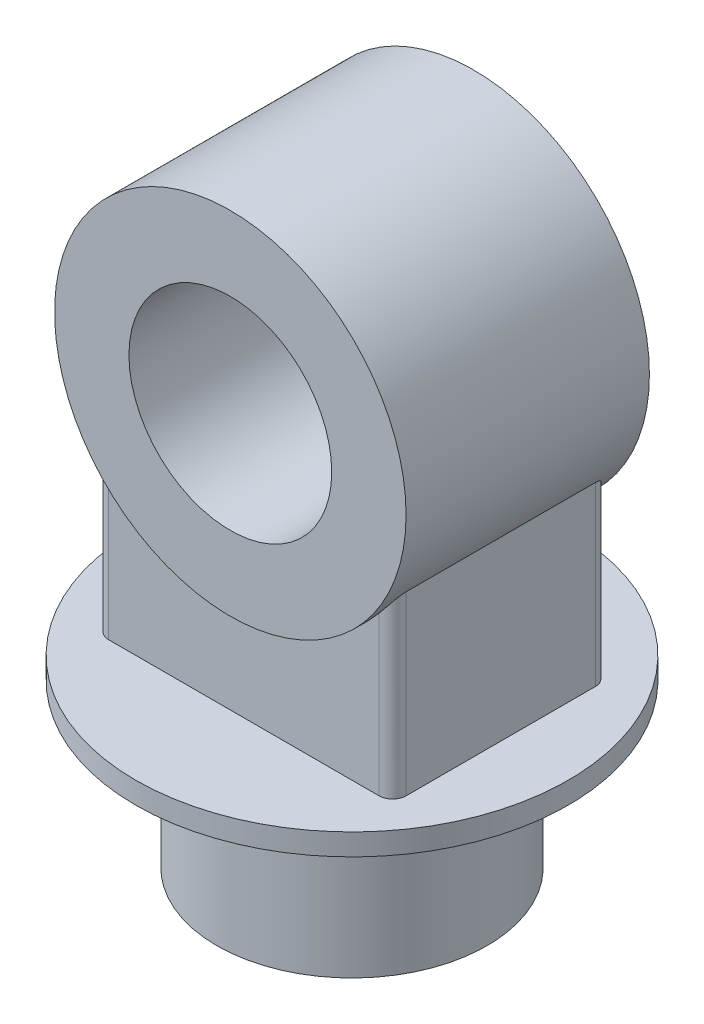
ISO-10303-21;
HEADER;
FILE_DESCRIPTION(('STEP AP214'),'2;1');
FILE_NAME('part.step','',(''),(''),'','','');
FILE_SCHEMA(('AUTOMOTIVE_DESIGN { 1 0 10303 214 1 1 1 1 }'));
ENDSEC;
DATA;
#1=APPLICATION_CONTEXT('core data for automotive mechanical design processes');
#2=APPLICATION_PROTOCOL_DEFINITION('international standard','automotive_design',2000,#1);
#3=PRODUCT_CONTEXT('',#1,'mechanical');
#4=PRODUCT('Part','Part','',(#3));
#5=PRODUCT_RELATED_PRODUCT_CATEGORY('part','',(#4));
#6=PRODUCT_DEFINITION_FORMATION('','',#4);
#7=PRODUCT_DEFINITION_CONTEXT('part definition',#1,'design');
#8=PRODUCT_DEFINITION('design','',#6,#7);
#9=PRODUCT_DEFINITION_SHAPE('','',#8);
#10=(LENGTH_UNIT() NAMED_UNIT(*) SI_UNIT(.MILLI.,.METRE.));
#11=(NAMED_UNIT(*) PLANE_ANGLE_UNIT() SI_UNIT($,.RADIAN.));
#12=(NAMED_UNIT(*) SI_UNIT($,.STERADIAN.) SOLID_ANGLE_UNIT());
#13=UNCERTAINTY_MEASURE_WITH_UNIT(LENGTH_MEASURE(1.E-05),#10,'distance_accuracy_value','');
#14=(GEOMETRIC_REPRESENTATION_CONTEXT(3) GLOBAL_UNCERTAINTY_ASSIGNED_CONTEXT((#13)) GLOBAL_UNIT_ASSIGNED_CONTEXT((#10,
#11,#12)) REPRESENTATION_CONTEXT('',''));
#15=CARTESIAN_POINT('',(0.,0.,0.));
#16=DIRECTION('',(0.,0.,1.));
#17=DIRECTION('',(1.,0.,0.));
#18=AXIS2_PLACEMENT_3D('',#15,#16,#17);
#19=CARTESIAN_POINT('',(0.,120.,0.));
#20=DIRECTION('',(0.,-1.,0.));
#21=DIRECTION('',(0.,0.,-1.));
#22=AXIS2_PLACEMENT_3D('',#19,#20,#21);
#23=CYLINDRICAL_SURFACE('',#22,100.);
#24=CARTESIAN_POINT('',(0.,120.,0.));
#25=DIRECTION('',(0.,1.,0.));
#26=DIRECTION('',(0.,0.,1.));
#27=AXIS2_PLACEMENT_3D('',#24,#25,#26);
#28=CIRCLE('',#27,100.);
#29=CARTESIAN_POINT('',(0.,120.,100.));
#30=VERTEX_POINT('',#29);
#31=EDGE_CURVE('E140',#30,#30,#28,.T.);
#32=ORIENTED_EDGE('',*,*,#31,.F.);
#33=EDGE_LOOP('',(#32));
#34=FACE_BOUND('',#33,.T.);
#35=CARTESIAN_POINT('',(0.,0.,0.));
#36=DIRECTION('',(0.,1.,0.));
#37=DIRECTION('',(0.,0.,1.));
#38=AXIS2_PLACEMENT_3D('',#35,#36,#37);
#39=CIRCLE('',#38,100.);
#40=CARTESIAN_POINT('',(0.,0.,100.));
#41=VERTEX_POINT('',#40);
#42=EDGE_CURVE('E209',#41,#41,#39,.T.);
#43=ORIENTED_EDGE('',*,*,#42,.T.);
#44=EDGE_LOOP('',(#43));
#45=FACE_BOUND('',#44,.T.);
#46=ADVANCED_FACE('F39',(#34,#45),#23,.T.);
#47=CARTESIAN_POINT('',(0.,0.,0.));
#48=DIRECTION('',(0.,1.,0.));
#49=DIRECTION('',(0.,0.,1.));
#50=AXIS2_PLACEMENT_3D('',#47,#48,#49);
#51=PLANE('',#50);
#52=ORIENTED_EDGE('',*,*,#42,.F.);
#53=EDGE_LOOP('',(#52));
#54=FACE_BOUND('',#53,.T.);
#55=ADVANCED_FACE('F217',(#54),#51,.F.);
#56=CARTESIAN_POINT('',(0.,136.,0.));
#57=DIRECTION('',(0.,-1.,0.));
#58=DIRECTION('',(0.,0.,-1.));
#59=AXIS2_PLACEMENT_3D('',#56,#57,#58);
#60=CYLINDRICAL_SURFACE('',#59,160.);
#61=CARTESIAN_POINT('',(0.,136.,0.));
#62=DIRECTION('',(0.,1.,0.));
#63=DIRECTION('',(0.,0.,1.));
#64=AXIS2_PLACEMENT_3D('',#61,#62,#63);
#65=CIRCLE('',#64,160.);
#66=CARTESIAN_POINT('',(0.,136.,160.));
#67=VERTEX_POINT('',#66);
#68=EDGE_CURVE('E206',#67,#67,#65,.T.);
#69=ORIENTED_EDGE('',*,*,#68,.F.);
#70=EDGE_LOOP('',(#69));
#71=FACE_BOUND('',#70,.T.);
#72=CARTESIAN_POINT('',(0.,120.,0.));
#73=DIRECTION('',(0.,1.,0.));
#74=DIRECTION('',(0.,0.,1.));
#75=AXIS2_PLACEMENT_3D('',#72,#73,#74);
#76=CIRCLE('',#75,160.);
#77=CARTESIAN_POINT('',(0.,120.,160.));
#78=VERTEX_POINT('',#77);
#79=EDGE_CURVE('E202',#78,#78,#76,.T.);
#80=ORIENTED_EDGE('',*,*,#79,.T.);
#81=EDGE_LOOP('',(#80));
#82=FACE_BOUND('',#81,.T.);
#83=ADVANCED_FACE('F219',(#71,#82),#60,.T.);
#84=CARTESIAN_POINT('',(0.,136.,0.));
#85=DIRECTION('',(0.,1.,0.));
#86=DIRECTION('',(0.,0.,1.));
#87=AXIS2_PLACEMENT_3D('',#84,#85,#86);
#88=PLANE('',#87);
#89=DIRECTION('',(0.,0.,1.));
#90=VECTOR('',#89,1.);
#91=CARTESIAN_POINT('',(-110.,136.,80.));
#92=LINE('',#91,#90);
#93=CARTESIAN_POINT('',(-110.,136.,-70.));
#94=VERTEX_POINT('',#93);
#95=CARTESIAN_POINT('',(-110.,136.,70.));
#96=VERTEX_POINT('',#95);
#97=EDGE_CURVE('E367',#94,#96,#92,.T.);
#98=ORIENTED_EDGE('',*,*,#97,.F.);
#99=CARTESIAN_POINT('',(-100.,136.,-70.));
#100=DIRECTION('',(0.,1.,0.));
#101=DIRECTION('',(0.,0.,1.));
#102=AXIS2_PLACEMENT_3D('',#99,#100,#101);
#103=CIRCLE('',#102,10.);
#104=CARTESIAN_POINT('',(-100.,136.,-80.));
#105=VERTEX_POINT('',#104);
#106=EDGE_CURVE('E122',#94,#105,#103,.F.);
#107=ORIENTED_EDGE('',*,*,#106,.T.);
#108=DIRECTION('',(-1.,0.,0.));
#109=VECTOR('',#108,1.);
#110=CARTESIAN_POINT('',(110.,136.,-80.));
#111=LINE('',#110,#109);
#112=CARTESIAN_POINT('',(100.,136.,-80.));
#113=VERTEX_POINT('',#112);
#114=EDGE_CURVE('E364',#113,#105,#111,.T.);
#115=ORIENTED_EDGE('',*,*,#114,.F.);
#116=CARTESIAN_POINT('',(100.,136.,-70.));
#117=DIRECTION('',(0.,1.,0.));
#118=DIRECTION('',(0.,0.,1.));
#119=AXIS2_PLACEMENT_3D('',#116,#117,#118);
#120=CIRCLE('',#119,10.);
#121=CARTESIAN_POINT('',(110.,136.,-70.));
#122=VERTEX_POINT('',#121);
#123=EDGE_CURVE('E60',#113,#122,#120,.F.);
#124=ORIENTED_EDGE('',*,*,#123,.T.);
#125=DIRECTION('',(0.,0.,-1.));
#126=VECTOR('',#125,1.);
#127=CARTESIAN_POINT('',(110.,136.,80.));
#128=LINE('',#127,#126);
#129=CARTESIAN_POINT('',(110.,136.,70.));
#130=VERTEX_POINT('',#129);
#131=EDGE_CURVE('E192',#130,#122,#128,.T.);
#132=ORIENTED_EDGE('',*,*,#131,.F.);
#133=CARTESIAN_POINT('',(100.,136.,70.));
#134=DIRECTION('',(0.,1.,0.));
#135=DIRECTION('',(0.,0.,1.));
#136=AXIS2_PLACEMENT_3D('',#133,#134,#135);
#137=CIRCLE('',#136,10.);
#138=CARTESIAN_POINT('',(100.,136.,80.));
#139=VERTEX_POINT('',#138);
#140=EDGE_CURVE('E53',#130,#139,#137,.F.);
#141=ORIENTED_EDGE('',*,*,#140,.T.);
#142=DIRECTION('',(1.,0.,0.));
#143=VECTOR('',#142,1.);
#144=CARTESIAN_POINT('',(110.,136.,80.));
#145=LINE('',#144,#143);
#146=CARTESIAN_POINT('',(-100.,136.,80.));
#147=VERTEX_POINT('',#146);
#148=EDGE_CURVE('E191',#147,#139,#145,.T.);
#149=ORIENTED_EDGE('',*,*,#148,.F.);
#150=CARTESIAN_POINT('',(-100.,136.,70.));
#151=DIRECTION('',(0.,1.,0.));
#152=DIRECTION('',(0.,0.,1.));
#153=AXIS2_PLACEMENT_3D('',#150,#151,#152);
#154=CIRCLE('',#153,10.);
#155=EDGE_CURVE('E123',#147,#96,#154,.F.);
#156=ORIENTED_EDGE('',*,*,#155,.T.);
#157=EDGE_LOOP('',(#98,#107,#115,#124,#132,#141,#149,#156));
#158=FACE_BOUND('',#157,.T.);
#159=ORIENTED_EDGE('',*,*,#68,.T.);
#160=EDGE_LOOP('',(#159));
#161=FACE_BOUND('',#160,.T.);
#162=ADVANCED_FACE('F189',(#158,#161),#88,.T.);
#163=CARTESIAN_POINT('',(0.,120.,0.));
#164=DIRECTION('',(0.,1.,0.));
#165=DIRECTION('',(0.,0.,1.));
#166=AXIS2_PLACEMENT_3D('',#163,#164,#165);
#167=PLANE('',#166);
#168=ORIENTED_EDGE('',*,*,#31,.T.);
#169=EDGE_LOOP('',(#168));
#170=FACE_BOUND('',#169,.T.);
#171=ORIENTED_EDGE('',*,*,#79,.F.);
#172=EDGE_LOOP('',(#171));
#173=FACE_BOUND('',#172,.T.);
#174=ADVANCED_FACE('F228',(#170,#173),#167,.F.);
#175=CARTESIAN_POINT('',(110.,466.002,80.));
#176=DIRECTION('',(0.,0.,-1.));
#177=DIRECTION('',(-1.,0.,0.));
#178=AXIS2_PLACEMENT_3D('',#175,#176,#177);
#179=PLANE('',#178);
#180=CARTESIAN_POINT('',(0.,336.,80.));
#181=DIRECTION('',(0.,0.,-1.));
#182=DIRECTION('',(-1.,0.,0.));
#183=AXIS2_PLACEMENT_3D('',#180,#181,#182);
#184=CIRCLE('',#183,130.);
#185=CARTESIAN_POINT('',(-100.,252.933761370819,80.));
#186=VERTEX_POINT('',#185);
#187=CARTESIAN_POINT('',(100.,252.933761370819,80.));
#188=VERTEX_POINT('',#187);
#189=EDGE_CURVE('E115',#186,#188,#184,.F.);
#190=ORIENTED_EDGE('',*,*,#189,.F.);
#191=DIRECTION('',(0.,-1.,0.));
#192=VECTOR('',#191,1.);
#193=CARTESIAN_POINT('',(-100.,466.002,80.));
#194=LINE('',#193,#192);
#195=EDGE_CURVE('E129',#186,#147,#194,.T.);
#196=ORIENTED_EDGE('',*,*,#195,.T.);
#197=ORIENTED_EDGE('',*,*,#148,.T.);
#198=DIRECTION('',(0.,-1.,0.));
#199=VECTOR('',#198,1.);
#200=CARTESIAN_POINT('',(100.,466.002,80.));
#201=LINE('',#200,#199);
#202=EDGE_CURVE('E131',#139,#188,#201,.F.);
#203=ORIENTED_EDGE('',*,*,#202,.T.);
#204=EDGE_LOOP('',(#190,#196,#197,#203));
#205=FACE_BOUND('',#204,.T.);
#206=ADVANCED_FACE('F127',(#205),#179,.F.);
#207=CARTESIAN_POINT('',(-110.,466.002,80.));
#208=DIRECTION('',(1.,0.,0.));
#209=DIRECTION('',(0.,0.,-1.));
#210=AXIS2_PLACEMENT_3D('',#207,#208,#209);
#211=PLANE('',#210);
#212=ORIENTED_EDGE('',*,*,#97,.T.);
#213=DIRECTION('',(0.,-1.,0.));
#214=VECTOR('',#213,1.);
#215=CARTESIAN_POINT('',(-110.,466.002,70.));
#216=LINE('',#215,#214);
#217=CARTESIAN_POINT('',(-110.,266.717967697245,70.));
#218=VERTEX_POINT('',#217);
#219=EDGE_CURVE('E138',#96,#218,#216,.F.);
#220=ORIENTED_EDGE('',*,*,#219,.T.);
#221=DIRECTION('',(0.,0.,-1.));
#222=VECTOR('',#221,1.);
#223=CARTESIAN_POINT('',(-110.,266.717967697245,90.));
#224=LINE('',#223,#222);
#225=CARTESIAN_POINT('',(-110.,266.717967697245,-69.9999999999999));
#226=VERTEX_POINT('',#225);
#227=EDGE_CURVE('E118',#226,#218,#224,.F.);
#228=ORIENTED_EDGE('',*,*,#227,.F.);
#229=DIRECTION('',(0.,-1.,0.));
#230=VECTOR('',#229,1.);
#231=CARTESIAN_POINT('',(-110.,466.002,-70.));
#232=LINE('',#231,#230);
#233=EDGE_CURVE('E135',#226,#94,#232,.T.);
#234=ORIENTED_EDGE('',*,*,#233,.T.);
#235=EDGE_LOOP('',(#212,#220,#228,#234));
#236=FACE_BOUND('',#235,.T.);
#237=ADVANCED_FACE('F234',(#236),#211,.F.);
#238=CARTESIAN_POINT('',(110.,466.002,80.));
#239=DIRECTION('',(-1.,0.,0.));
#240=DIRECTION('',(0.,0.,1.));
#241=AXIS2_PLACEMENT_3D('',#238,#239,#240);
#242=PLANE('',#241);
#243=ORIENTED_EDGE('',*,*,#131,.T.);
#244=DIRECTION('',(0.,-1.,0.));
#245=VECTOR('',#244,1.);
#246=CARTESIAN_POINT('',(110.,466.002,-70.));
#247=LINE('',#246,#245);
#248=CARTESIAN_POINT('',(110.,266.717967697245,-69.9999999999999));
#249=VERTEX_POINT('',#248);
#250=EDGE_CURVE('E152',#122,#249,#247,.F.);
#251=ORIENTED_EDGE('',*,*,#250,.T.);
#252=DIRECTION('',(0.,0.,-1.));
#253=VECTOR('',#252,1.);
#254=CARTESIAN_POINT('',(110.,266.717967697245,90.));
#255=LINE('',#254,#253);
#256=CARTESIAN_POINT('',(110.,266.717967697245,70.));
#257=VERTEX_POINT('',#256);
#258=EDGE_CURVE('E132',#257,#249,#255,.T.);
#259=ORIENTED_EDGE('',*,*,#258,.F.);
#260=DIRECTION('',(0.,-1.,0.));
#261=VECTOR('',#260,1.);
#262=CARTESIAN_POINT('',(110.,466.002,70.));
#263=LINE('',#262,#261);
#264=EDGE_CURVE('E150',#257,#130,#263,.T.);
#265=ORIENTED_EDGE('',*,*,#264,.T.);
#266=EDGE_LOOP('',(#243,#251,#259,#265));
#267=FACE_BOUND('',#266,.T.);
#268=ADVANCED_FACE('F198',(#267),#242,.F.);
#269=CARTESIAN_POINT('',(110.,466.002,-80.));
#270=DIRECTION('',(0.,0.,1.));
#271=DIRECTION('',(1.,0.,0.));
#272=AXIS2_PLACEMENT_3D('',#269,#270,#271);
#273=PLANE('',#272);
#274=ORIENTED_EDGE('',*,*,#114,.T.);
#275=DIRECTION('',(0.,-1.,0.));
#276=VECTOR('',#275,1.);
#277=CARTESIAN_POINT('',(-100.,466.002,-80.));
#278=LINE('',#277,#276);
#279=CARTESIAN_POINT('',(-100.,252.933761370819,-79.9999999999999));
#280=VERTEX_POINT('',#279);
#281=EDGE_CURVE('E148',#105,#280,#278,.F.);
#282=ORIENTED_EDGE('',*,*,#281,.T.);
#283=CARTESIAN_POINT('',(0.,336.,-80.));
#284=DIRECTION('',(0.,0.,1.));
#285=DIRECTION('',(1.,0.,0.));
#286=AXIS2_PLACEMENT_3D('',#283,#284,#285);
#287=CIRCLE('',#286,130.);
#288=CARTESIAN_POINT('',(100.,252.933761370819,-80.));
#289=VERTEX_POINT('',#288);
#290=EDGE_CURVE('E200',#289,#280,#287,.F.);
#291=ORIENTED_EDGE('',*,*,#290,.F.);
#292=DIRECTION('',(0.,-1.,0.));
#293=VECTOR('',#292,1.);
#294=CARTESIAN_POINT('',(100.,466.002,-80.));
#295=LINE('',#294,#293);
#296=EDGE_CURVE('E145',#289,#113,#295,.T.);
#297=ORIENTED_EDGE('',*,*,#296,.T.);
#298=EDGE_LOOP('',(#274,#282,#291,#297));
#299=FACE_BOUND('',#298,.T.);
#300=ADVANCED_FACE('F238',(#299),#273,.F.);
#301=CARTESIAN_POINT('',(0.,336.,90.));
#302=DIRECTION('',(0.,0.,-1.));
#303=DIRECTION('',(-1.,0.,0.));
#304=AXIS2_PLACEMENT_3D('',#301,#302,#303);
#305=CYLINDRICAL_SURFACE('',#304,130.);
#306=CARTESIAN_POINT('',(0.,336.,90.));
#307=DIRECTION('',(0.,0.,1.));
#308=DIRECTION('',(1.,0.,0.));
#309=AXIS2_PLACEMENT_3D('',#306,#307,#308);
#310=CIRCLE('',#309,130.);
#311=CARTESIAN_POINT('',(130.,336.,90.));
#312=VERTEX_POINT('',#311);
#313=EDGE_CURVE('E368',#312,#312,#310,.T.);
#314=ORIENTED_EDGE('',*,*,#313,.F.);
#315=EDGE_LOOP('',(#314));
#316=FACE_BOUND('',#315,.T.);
#317=CARTESIAN_POINT('',(0.,336.,-90.));
#318=DIRECTION('',(0.,0.,1.));
#319=DIRECTION('',(1.,0.,0.));
#320=AXIS2_PLACEMENT_3D('',#317,#318,#319);
#321=CIRCLE('',#320,130.);
#322=CARTESIAN_POINT('',(130.,336.,-90.));
#323=VERTEX_POINT('',#322);
#324=EDGE_CURVE('E372',#323,#323,#321,.T.);
#325=ORIENTED_EDGE('',*,*,#324,.T.);
#326=EDGE_LOOP('',(#325));
#327=FACE_BOUND('',#326,.T.);
#328=ORIENTED_EDGE('',*,*,#290,.T.);
#329=CARTESIAN_POINT('',(-100.,252.933761370819,-80.));
#330=CARTESIAN_POINT('',(-100.223611151915,253.202952503255,-79.9999830665315));
#331=CARTESIAN_POINT('',(-100.446118360057,253.473036166024,-79.9924995885084));
#332=CARTESIAN_POINT('',(-100.888548742496,254.014496760122,-79.9629173131462));
#333=CARTESIAN_POINT('',(-101.108472043759,254.285873626978,-79.9408192370115));
#334=CARTESIAN_POINT('',(-101.545586290072,254.829711400373,-79.8822979337703));
#335=CARTESIAN_POINT('',(-101.76277446753,255.102173087004,-79.8458612385231));
#336=CARTESIAN_POINT('',(-102.193849033468,255.647413797012,-79.7588609087487));
#337=CARTESIAN_POINT('',(-102.407735374993,255.920192824843,-79.7082970735217));
#338=CARTESIAN_POINT('',(-103.048408055095,256.74400885936,-79.5343891784366));
#339=CARTESIAN_POINT('',(-103.469748368072,257.294974230618,-79.3894263280957));
#340=CARTESIAN_POINT('',(-104.088382224678,258.117224843771,-79.1288060997197));
#341=CARTESIAN_POINT('',(-104.292337034927,258.39057162742,-79.0347525474724));
#342=CARTESIAN_POINT('',(-104.695498702643,258.935304765081,-78.8319429710981));
#343=CARTESIAN_POINT('',(-104.894706004332,259.206691300842,-78.7231883289498));
#344=CARTESIAN_POINT('',(-105.336170271764,259.812965668139,-78.4620472638272));
#345=CARTESIAN_POINT('',(-105.577006541077,260.147108038148,-78.3055009036513));
#346=CARTESIAN_POINT('',(-106.04966094987,260.809343252621,-77.967808626391));
#347=CARTESIAN_POINT('',(-106.281479043935,261.137436066616,-77.7866625854443));
#348=CARTESIAN_POINT('',(-106.734152264033,261.784259610706,-77.3986376161628));
#349=CARTESIAN_POINT('',(-106.955036134368,262.103013877598,-77.1918317878757));
#350=CARTESIAN_POINT('',(-107.384708325122,262.728803605627,-76.7498943920219));
#351=CARTESIAN_POINT('',(-107.593501627276,263.035843875289,-76.5147746155491));
#352=CARTESIAN_POINT('',(-107.921279015409,263.522080966666,-76.1068757916445));
#353=CARTESIAN_POINT('',(-108.044709884718,263.706240813682,-75.9435605188262));
#354=CARTESIAN_POINT('',(-108.284949666933,264.066582834907,-75.6038296157538));
#355=CARTESIAN_POINT('',(-108.401760304956,264.242767084986,-75.4274174262628));
#356=CARTESIAN_POINT('',(-108.627683741988,264.585236991633,-75.0605773993745));
#357=CARTESIAN_POINT('',(-108.736797961361,264.751524473746,-74.8701521613912));
#358=CARTESIAN_POINT('',(-108.945874410432,265.071634412635,-74.4745306992527));
#359=CARTESIAN_POINT('',(-109.04583974995,265.225461102935,-74.2693395369044));
#360=CARTESIAN_POINT('',(-109.274660386151,265.579056080623,-73.7536743100226));
#361=CARTESIAN_POINT('',(-109.398046362816,265.771031349643,-73.4351396850741));
#362=CARTESIAN_POINT('',(-109.561336457207,266.026263049992,-72.9345418523035));
#363=CARTESIAN_POINT('',(-109.612072269395,266.105785634321,-72.7641622498836));
#364=CARTESIAN_POINT('',(-109.705421847597,266.25239837099,-72.4160328323222));
#365=CARTESIAN_POINT('',(-109.748040656091,266.319496241142,-72.2382876769632));
#366=CARTESIAN_POINT('',(-109.820262744001,266.433384610412,-71.8947331689276));
#367=CARTESIAN_POINT('',(-109.850752312767,266.481551609067,-71.729567610939));
#368=CARTESIAN_POINT('',(-109.903691363628,266.565274678987,-71.3948451418076));
#369=CARTESIAN_POINT('',(-109.926143541964,266.600834979285,-71.2252897238033));
#370=CARTESIAN_POINT('',(-109.962659042777,266.658707696818,-70.8807814271977));
#371=CARTESIAN_POINT('',(-109.976613864032,266.680848750137,-70.7057875562757));
#372=CARTESIAN_POINT('',(-109.99061964662,266.703076138542,-70.4419386674802));
#373=CARTESIAN_POINT('',(-109.99413386492,266.708654625171,-70.3536902139711));
#374=CARTESIAN_POINT('',(-109.998824989492,266.716102079046,-70.1769662160102));
#375=CARTESIAN_POINT('',(-110.000001659485,266.717970671296,-70.088490649507));
#376=CARTESIAN_POINT('',(-110.,266.717967697245,-70.));
#377=B_SPLINE_CURVE_WITH_KNOTS('',3,(#329,#330,#331,#332,#333,#334,#335,#336,#337,#338,#339,
#340,#341,#342,#343,#344,#345,#346,#347,#348,#349,#350,#351,#352,#353,#354,#355,#356,#357,#358,
#359,#360,#361,#362,#363,#364,#365,#366,#367,#368,#369,#370,#371,#372,#373,#374,#375,#376),
.UNSPECIFIED.,.F.,.F.,(4,2,2,2,2,2,2,2,2,2,2,2,2,2,2,2,2,2,2,2,2,2,2,4),(0.,1.04974156507783,
2.09943133114567,3.15010942417265,4.20080244462032,6.32356278933861,7.38465211465335,
8.44564176134501,9.76677685539396,11.0879186017609,12.4053795382949,13.7222937149077,
14.5479419827464,15.3733741023698,16.1986534888326,17.023651302289,18.194686650492,
18.7783719827905,19.3616935243415,19.8852298594992,20.4085904030381,20.9385006934629,
21.2038887699912,21.4693036704869),.UNSPECIFIED.);
#378=EDGE_CURVE('E176',#280,#226,#377,.T.);
#379=ORIENTED_EDGE('',*,*,#378,.T.);
#380=ORIENTED_EDGE('',*,*,#227,.T.);
#381=CARTESIAN_POINT('',(-110.,266.717967697245,70.));
#382=CARTESIAN_POINT('',(-110.000033683462,266.718025852698,70.1614230595313));
#383=CARTESIAN_POINT('',(-109.996092792414,266.711764254296,70.3228118197691));
#384=CARTESIAN_POINT('',(-109.980519982779,266.687045880384,70.6441123999958));
#385=CARTESIAN_POINT('',(-109.968896213713,266.668602027069,70.8040256031146));
#386=CARTESIAN_POINT('',(-109.938376398954,266.620217986395,71.1196424551221));
#387=CARTESIAN_POINT('',(-109.919558261622,266.590400967593,71.2753727040436));
#388=CARTESIAN_POINT('',(-109.875071558334,266.52000006118,71.5834085562727));
#389=CARTESIAN_POINT('',(-109.849400846184,266.479412800404,71.735713070425));
#390=CARTESIAN_POINT('',(-109.784772267017,266.377386983169,72.0722520040974));
#391=CARTESIAN_POINT('',(-109.744103525393,266.313281105856,72.2553511890568));
#392=CARTESIAN_POINT('',(-109.654040532803,266.17165023193,72.6141464391851));
#393=CARTESIAN_POINT('',(-109.604640075501,266.094115691273,72.7898371277865));
#394=CARTESIAN_POINT('',(-109.497968805892,265.927147418338,73.1338723913451));
#395=CARTESIAN_POINT('',(-109.440667457039,265.837667562915,73.302184951541));
#396=CARTESIAN_POINT('',(-109.319341126161,265.648779195145,73.6304969218558));
#397=CARTESIAN_POINT('',(-109.25531768694,265.549372961282,73.7904982269664));
#398=CARTESIAN_POINT('',(-109.085069343255,265.28590129292,74.186887646321));
#399=CARTESIAN_POINT('',(-108.974781990569,265.115997241409,74.4176642111939));
#400=CARTESIAN_POINT('',(-108.742772943656,264.76058359918,74.8607110351427));
#401=CARTESIAN_POINT('',(-108.621044869784,264.575065307649,75.072970840064));
#402=CARTESIAN_POINT('',(-108.36794946479,264.19164129378,75.4804206329535));
#403=CARTESIAN_POINT('',(-108.236568322626,263.993717884812,75.6755852518653));
#404=CARTESIAN_POINT('',(-107.965814499919,263.588382733387,76.0497203250662));
#405=CARTESIAN_POINT('',(-107.826442440892,263.380971729107,76.2286920360201));
#406=CARTESIAN_POINT('',(-107.56145650763,262.989174407744,76.5468161797372));
#407=CARTESIAN_POINT('',(-107.436764821801,262.805791987749,76.6879854690674));
#408=CARTESIAN_POINT('',(-107.182869679799,262.434497987953,76.9599552926783));
#409=CARTESIAN_POINT('',(-107.053665586411,262.24658576965,77.0907543539386));
#410=CARTESIAN_POINT('',(-106.659844344167,261.677121003612,77.4685356621902));
#411=CARTESIAN_POINT('',(-106.389102445143,261.289965080353,77.7008024816961));
#412=CARTESIAN_POINT('',(-105.833418194947,260.504836154638,78.129863631631));
#413=CARTESIAN_POINT('',(-105.548442441802,260.106838810795,78.3265689888296));
#414=CARTESIAN_POINT('',(-104.96676628824,259.304344779382,78.6860846955171));
#415=CARTESIAN_POINT('',(-104.670068038633,258.899849292081,78.8489012287858));
#416=CARTESIAN_POINT('',(-104.024574509401,258.030646711215,79.1623550419402));
#417=CARTESIAN_POINT('',(-103.674248758637,257.565348460988,79.3081944572228));
#418=CARTESIAN_POINT('',(-102.961876677953,256.632523338709,79.558756520093));
#419=CARTESIAN_POINT('',(-102.599828734006,256.16499616738,79.6634734792563));
#420=CARTESIAN_POINT('',(-102.051092736822,255.466397204689,79.7891645729388));
#421=CARTESIAN_POINT('',(-101.868137468165,255.235094848973,79.8257282191265));
#422=CARTESIAN_POINT('',(-101.499966150616,254.77288550036,79.8886289353229));
#423=CARTESIAN_POINT('',(-101.314750133026,254.541978502041,79.9149661467555));
#424=CARTESIAN_POINT('',(-100.942320486513,254.080919722901,79.9572665465168));
#425=CARTESIAN_POINT('',(-100.755107350153,253.850767773367,79.9732322353467));
#426=CARTESIAN_POINT('',(-100.378860262163,253.391449185777,79.9945948234744));
#427=CARTESIAN_POINT('',(-100.189826234412,253.162282589497,79.9999912789888));
#428=CARTESIAN_POINT('',(-100.,252.933761370819,80.));
#429=B_SPLINE_CURVE_WITH_KNOTS('',3,(#381,#382,#383,#384,#385,#386,#387,#388,#389,#390,#391,
#392,#393,#394,#395,#396,#397,#398,#399,#400,#401,#402,#403,#404,#405,#406,#407,#408,#409,#410,
#411,#412,#413,#414,#415,#416,#417,#418,#419,#420,#421,#422,#423,#424,#425,#426,#427,#428),
.UNSPECIFIED.,.F.,.F.,(4,2,2,2,2,2,2,2,2,2,2,2,2,2,2,2,2,2,2,2,2,2,2,4),(0.,0.484045005923069,
0.967577389145413,1.44601544684509,1.92460352520314,2.51835043890467,3.11252108624072,
3.7090561398874,4.30545457926273,5.22516595363376,6.14539326092329,7.06696382284195,
7.98846280401965,8.77680092000537,9.56525081419898,11.1426900482286,12.7240229357798,
14.305067020047,16.1047501551828,17.9046821508917,18.7960435003637,19.6873925225409,
20.5785265668948,21.4696980275819),.UNSPECIFIED.);
#430=EDGE_CURVE('E111',#218,#186,#429,.T.);
#431=ORIENTED_EDGE('',*,*,#430,.T.);
#432=ORIENTED_EDGE('',*,*,#189,.T.);
#433=CARTESIAN_POINT('',(100.,252.933761370819,80.));
#434=CARTESIAN_POINT('',(100.223611151915,253.202952503255,79.9999830665315));
#435=CARTESIAN_POINT('',(100.446118360057,253.473036166024,79.9924995885085));
#436=CARTESIAN_POINT('',(100.888548742496,254.014496760122,79.9629173131463));
#437=CARTESIAN_POINT('',(101.108472043759,254.285873626978,79.9408192370116));
#438=CARTESIAN_POINT('',(101.545586290072,254.829711400373,79.8822979337703));
#439=CARTESIAN_POINT('',(101.76277446753,255.102173087004,79.8458612385231));
#440=CARTESIAN_POINT('',(102.193849033468,255.647413797012,79.7588609087488));
#441=CARTESIAN_POINT('',(102.407735374993,255.920192824843,79.7082970735217));
#442=CARTESIAN_POINT('',(103.048408055095,256.74400885936,79.5343891784366));
#443=CARTESIAN_POINT('',(103.469748368072,257.294974230618,79.3894263280958));
#444=CARTESIAN_POINT('',(104.088382224678,258.117224843771,79.1288060997198));
#445=CARTESIAN_POINT('',(104.292337034927,258.39057162742,79.0347525474725));
#446=CARTESIAN_POINT('',(104.695498702643,258.935304765081,78.8319429710982));
#447=CARTESIAN_POINT('',(104.894706004332,259.206691300842,78.7231883289499));
#448=CARTESIAN_POINT('',(105.336170271764,259.812965668139,78.4620472638272));
#449=CARTESIAN_POINT('',(105.577006541077,260.147108038148,78.3055009036513));
#450=CARTESIAN_POINT('',(106.04966094987,260.809343252621,77.967808626391));
#451=CARTESIAN_POINT('',(106.281479043935,261.137436066616,77.7866625854444));
#452=CARTESIAN_POINT('',(106.734152264033,261.784259610706,77.3986376161629));
#453=CARTESIAN_POINT('',(106.955036134368,262.103013877599,77.1918317878758));
#454=CARTESIAN_POINT('',(107.384708325122,262.728803605627,76.7498943920221));
#455=CARTESIAN_POINT('',(107.593501627276,263.035843875289,76.5147746155493));
#456=CARTESIAN_POINT('',(107.921279015409,263.522080966666,76.1068757916446));
#457=CARTESIAN_POINT('',(108.044709884718,263.706240813682,75.9435605188263));
#458=CARTESIAN_POINT('',(108.284949666933,264.066582834907,75.6038296157539));
#459=CARTESIAN_POINT('',(108.401760304956,264.242767084986,75.4274174262629));
#460=CARTESIAN_POINT('',(108.627683741988,264.585236991633,75.0605773993747));
#461=CARTESIAN_POINT('',(108.736797961361,264.751524473746,74.8701521613913));
#462=CARTESIAN_POINT('',(108.945874410432,265.071634412635,74.4745306992528));
#463=CARTESIAN_POINT('',(109.04583974995,265.225461102935,74.2693395369045));
#464=CARTESIAN_POINT('',(109.274660386151,265.579056080623,73.7536743100228));
#465=CARTESIAN_POINT('',(109.398046362816,265.771031349643,73.4351396850743));
#466=CARTESIAN_POINT('',(109.561336457207,266.026263049992,72.9345418523036));
#467=CARTESIAN_POINT('',(109.612072269395,266.105785634321,72.7641622498837));
#468=CARTESIAN_POINT('',(109.705421847597,266.25239837099,72.4160328323223));
#469=CARTESIAN_POINT('',(109.748040656091,266.319496241142,72.2382876769633));
#470=CARTESIAN_POINT('',(109.820262744001,266.433384610412,71.8947331689277));
#471=CARTESIAN_POINT('',(109.850752312767,266.481551609067,71.7295676109391));
#472=CARTESIAN_POINT('',(109.903691363628,266.565274678988,71.3948451418077));
#473=CARTESIAN_POINT('',(109.926143541964,266.600834979285,71.2252897238034));
#474=CARTESIAN_POINT('',(109.962659042777,266.658707696818,70.8807814271978));
#475=CARTESIAN_POINT('',(109.976613864032,266.680848750137,70.7057875562757));
#476=CARTESIAN_POINT('',(109.99061964662,266.703076138542,70.4419386674803));
#477=CARTESIAN_POINT('',(109.99413386492,266.708654625171,70.3536902139711));
#478=CARTESIAN_POINT('',(109.998824989492,266.716102079046,70.1769662160102));
#479=CARTESIAN_POINT('',(110.000001659485,266.717970671296,70.088490649507));
#480=CARTESIAN_POINT('',(110.,266.717967697245,70.));
#481=B_SPLINE_CURVE_WITH_KNOTS('',3,(#433,#434,#435,#436,#437,#438,#439,#440,#441,#442,#443,
#444,#445,#446,#447,#448,#449,#450,#451,#452,#453,#454,#455,#456,#457,#458,#459,#460,#461,#462,
#463,#464,#465,#466,#467,#468,#469,#470,#471,#472,#473,#474,#475,#476,#477,#478,#479,#480),
.UNSPECIFIED.,.F.,.F.,(4,2,2,2,2,2,2,2,2,2,2,2,2,2,2,2,2,2,2,2,2,2,2,4),(0.,1.04974156507777,
2.09943133114568,3.1501094241726,4.20080244462026,6.32356278933854,7.38465211465329,
8.44564176134495,9.76677685539391,11.0879186017609,12.4053795382948,13.7222937149076,
14.5479419827463,15.3733741023697,16.1986534888326,17.0236513022889,18.1946866504919,
18.7783719827904,19.3616935243414,19.8852298594992,20.408590403038,20.9385006934629,
21.2038887699912,21.4693036704869),.UNSPECIFIED.);
#482=EDGE_CURVE('E11',#188,#257,#481,.T.);
#483=ORIENTED_EDGE('',*,*,#482,.T.);
#484=ORIENTED_EDGE('',*,*,#258,.T.);
#485=CARTESIAN_POINT('',(110.,266.717967697245,-70.));
#486=CARTESIAN_POINT('',(110.000033683462,266.718025852698,-70.1614230595313));
#487=CARTESIAN_POINT('',(109.996092792414,266.711764254296,-70.3228118197691));
#488=CARTESIAN_POINT('',(109.980519982779,266.687045880384,-70.6441123999957));
#489=CARTESIAN_POINT('',(109.968896213713,266.668602027069,-70.8040256031146));
#490=CARTESIAN_POINT('',(109.938376398954,266.620217986395,-71.1196424551221));
#491=CARTESIAN_POINT('',(109.919558261622,266.590400967593,-71.2753727040436));
#492=CARTESIAN_POINT('',(109.875071558334,266.52000006118,-71.5834085562726));
#493=CARTESIAN_POINT('',(109.849400846184,266.479412800404,-71.7357130704249));
#494=CARTESIAN_POINT('',(109.784772267017,266.377386983169,-72.0722520040974));
#495=CARTESIAN_POINT('',(109.744103525393,266.313281105856,-72.2553511890568));
#496=CARTESIAN_POINT('',(109.654040532803,266.17165023193,-72.6141464391851));
#497=CARTESIAN_POINT('',(109.604640075501,266.094115691273,-72.7898371277865));
#498=CARTESIAN_POINT('',(109.497968805892,265.927147418338,-73.133872391345));
#499=CARTESIAN_POINT('',(109.440667457039,265.837667562915,-73.302184951541));
#500=CARTESIAN_POINT('',(109.319341126161,265.648779195145,-73.6304969218558));
#501=CARTESIAN_POINT('',(109.25531768694,265.549372961282,-73.7904982269664));
#502=CARTESIAN_POINT('',(109.085069343255,265.28590129292,-74.1868876463209));
#503=CARTESIAN_POINT('',(108.974781990569,265.115997241409,-74.4176642111939));
#504=CARTESIAN_POINT('',(108.742772943656,264.76058359918,-74.8607110351426));
#505=CARTESIAN_POINT('',(108.621044869784,264.575065307649,-75.072970840064));
#506=CARTESIAN_POINT('',(108.36794946479,264.19164129378,-75.4804206329534));
#507=CARTESIAN_POINT('',(108.236568322626,263.993717884812,-75.6755852518652));
#508=CARTESIAN_POINT('',(107.965814499919,263.588382733388,-76.0497203250662));
#509=CARTESIAN_POINT('',(107.826442440892,263.380971729107,-76.2286920360201));
#510=CARTESIAN_POINT('',(107.56145650763,262.989174407744,-76.5468161797372));
#511=CARTESIAN_POINT('',(107.436764821801,262.805791987749,-76.6879854690674));
#512=CARTESIAN_POINT('',(107.182869679799,262.434497987953,-76.9599552926783));
#513=CARTESIAN_POINT('',(107.053665586411,262.24658576965,-77.0907543539386));
#514=CARTESIAN_POINT('',(106.659844344167,261.677121003612,-77.4685356621902));
#515=CARTESIAN_POINT('',(106.389102445143,261.289965080353,-77.7008024816961));
#516=CARTESIAN_POINT('',(105.833418194947,260.504836154638,-78.129863631631));
#517=CARTESIAN_POINT('',(105.548442441802,260.106838810795,-78.3265689888296));
#518=CARTESIAN_POINT('',(104.96676628824,259.304344779382,-78.6860846955171));
#519=CARTESIAN_POINT('',(104.670068038633,258.899849292081,-78.8489012287858));
#520=CARTESIAN_POINT('',(104.024574509401,258.030646711215,-79.1623550419402));
#521=CARTESIAN_POINT('',(103.674248758637,257.565348460988,-79.3081944572228));
#522=CARTESIAN_POINT('',(102.961876677953,256.632523338709,-79.558756520093));
#523=CARTESIAN_POINT('',(102.599828734006,256.16499616738,-79.6634734792563));
#524=CARTESIAN_POINT('',(102.051092736822,255.466397204689,-79.7891645729387));
#525=CARTESIAN_POINT('',(101.868137468165,255.235094848973,-79.8257282191264));
#526=CARTESIAN_POINT('',(101.499966150616,254.77288550036,-79.8886289353229));
#527=CARTESIAN_POINT('',(101.314750133026,254.541978502041,-79.9149661467555));
#528=CARTESIAN_POINT('',(100.942320486513,254.080919722901,-79.9572665465167));
#529=CARTESIAN_POINT('',(100.755107350153,253.850767773367,-79.9732322353467));
#530=CARTESIAN_POINT('',(100.378860262163,253.391449185777,-79.9945948234744));
#531=CARTESIAN_POINT('',(100.189826234412,253.162282589497,-79.9999912789887));
#532=CARTESIAN_POINT('',(100.,252.933761370819,-80.));
#533=B_SPLINE_CURVE_WITH_KNOTS('',3,(#485,#486,#487,#488,#489,#490,#491,#492,#493,#494,#495,
#496,#497,#498,#499,#500,#501,#502,#503,#504,#505,#506,#507,#508,#509,#510,#511,#512,#513,#514,
#515,#516,#517,#518,#519,#520,#521,#522,#523,#524,#525,#526,#527,#528,#529,#530,#531,#532),
.UNSPECIFIED.,.F.,.F.,(4,2,2,2,2,2,2,2,2,2,2,2,2,2,2,2,2,2,2,2,2,2,2,4),(0.,0.484045005923086,
0.967577389145422,1.44601544684507,1.92460352520313,2.51835043890468,3.11252108624077,
3.70905613988741,4.30545457926274,5.22516595363374,6.14539326092329,7.06696382284192,
7.98846280401962,8.7768009200054,9.56525081419895,11.1426900482287,12.7240229357798,
14.305067020047,16.1047501551828,17.9046821508918,18.7960435003638,19.6873925225409,
20.5785265668947,21.4696980275819),.UNSPECIFIED.);
#534=EDGE_CURVE('E183',#249,#289,#533,.T.);
#535=ORIENTED_EDGE('',*,*,#534,.T.);
#536=EDGE_LOOP('',(#328,#379,#380,#431,#432,#483,#484,#535));
#537=FACE_BOUND('',#536,.T.);
#538=ADVANCED_FACE('F114',(#316,#327,#537),#305,.T.);
#539=CARTESIAN_POINT('',(0.,336.,90.));
#540=DIRECTION('',(0.,0.,1.));
#541=DIRECTION('',(1.,0.,0.));
#542=AXIS2_PLACEMENT_3D('',#539,#540,#541);
#543=PLANE('',#542);
#544=ORIENTED_EDGE('',*,*,#313,.T.);
#545=EDGE_LOOP('',(#544));
#546=FACE_BOUND('',#545,.T.);
#547=CARTESIAN_POINT('',(0.,336.,90.));
#548=DIRECTION('',(0.,0.,1.));
#549=DIRECTION('',(1.,0.,0.));
#550=AXIS2_PLACEMENT_3D('',#547,#548,#549);
#551=CIRCLE('',#550,75.);
#552=CARTESIAN_POINT('',(-75.,336.,90.));
#553=VERTEX_POINT('',#552);
#554=EDGE_CURVE('E377',#553,#553,#551,.T.);
#555=ORIENTED_EDGE('',*,*,#554,.F.);
#556=EDGE_LOOP('',(#555));
#557=FACE_BOUND('',#556,.T.);
#558=ADVANCED_FACE('F267',(#546,#557),#543,.T.);
#559=CARTESIAN_POINT('',(0.,336.,-90.));
#560=DIRECTION('',(0.,0.,1.));
#561=DIRECTION('',(1.,0.,0.));
#562=AXIS2_PLACEMENT_3D('',#559,#560,#561);
#563=PLANE('',#562);
#564=ORIENTED_EDGE('',*,*,#324,.F.);
#565=EDGE_LOOP('',(#564));
#566=FACE_BOUND('',#565,.T.);
#567=CARTESIAN_POINT('',(0.,336.,-90.));
#568=DIRECTION('',(0.,0.,1.));
#569=DIRECTION('',(1.,0.,0.));
#570=AXIS2_PLACEMENT_3D('',#567,#568,#569);
#571=CIRCLE('',#570,75.);
#572=CARTESIAN_POINT('',(-75.,336.,-90.));
#573=VERTEX_POINT('',#572);
#574=EDGE_CURVE('E379',#573,#573,#571,.T.);
#575=ORIENTED_EDGE('',*,*,#574,.T.);
#576=EDGE_LOOP('',(#575));
#577=FACE_BOUND('',#576,.T.);
#578=ADVANCED_FACE('F275',(#566,#577),#563,.F.);
#579=CARTESIAN_POINT('',(0.,336.,90.));
#580=DIRECTION('',(0.,0.,-1.));
#581=DIRECTION('',(-1.,0.,0.));
#582=AXIS2_PLACEMENT_3D('',#579,#580,#581);
#583=CYLINDRICAL_SURFACE('',#582,75.);
#584=CARTESIAN_POINT('',(-75.,336.,90.));
#585=CARTESIAN_POINT('',(-75.,336.,88.125));
#586=CARTESIAN_POINT('',(-75.,336.,86.25));
#587=CARTESIAN_POINT('',(-75.,336.,82.5));
#588=CARTESIAN_POINT('',(-75.,336.,80.625));
#589=CARTESIAN_POINT('',(-75.,336.,76.875));
#590=CARTESIAN_POINT('',(-75.,336.,75.));
#591=CARTESIAN_POINT('',(-75.,336.,71.25));
#592=CARTESIAN_POINT('',(-75.,336.,69.375));
#593=CARTESIAN_POINT('',(-75.,336.,65.625));
#594=CARTESIAN_POINT('',(-75.,336.,63.75));
#595=CARTESIAN_POINT('',(-75.,336.,60.));
#596=CARTESIAN_POINT('',(-75.,336.,58.125));
#597=CARTESIAN_POINT('',(-75.,336.,54.375));
#598=CARTESIAN_POINT('',(-75.,336.,52.5));
#599=CARTESIAN_POINT('',(-75.,336.,48.75));
#600=CARTESIAN_POINT('',(-75.,336.,46.875));
#601=CARTESIAN_POINT('',(-75.,336.,43.125));
#602=CARTESIAN_POINT('',(-75.,336.,41.25));
#603=CARTESIAN_POINT('',(-75.,336.,37.5));
#604=CARTESIAN_POINT('',(-75.,336.,35.625));
#605=CARTESIAN_POINT('',(-75.,336.,31.875));
#606=CARTESIAN_POINT('',(-75.,336.,30.));
#607=CARTESIAN_POINT('',(-75.,336.,26.25));
#608=CARTESIAN_POINT('',(-75.,336.,24.375));
#609=CARTESIAN_POINT('',(-75.,336.,20.625));
#610=CARTESIAN_POINT('',(-75.,336.,18.75));
#611=CARTESIAN_POINT('',(-75.,336.,15.));
#612=CARTESIAN_POINT('',(-75.,336.,13.125));
#613=CARTESIAN_POINT('',(-75.,336.,9.37499999999998));
#614=CARTESIAN_POINT('',(-75.,336.,7.49999999999998));
#615=CARTESIAN_POINT('',(-75.,336.,3.74999999999998));
#616=CARTESIAN_POINT('',(-75.,336.,1.87499999999997));
#617=CARTESIAN_POINT('',(-75.,336.,-1.87500000000003));
#618=CARTESIAN_POINT('',(-75.,336.,-3.75000000000003));
#619=CARTESIAN_POINT('',(-75.,336.,-7.50000000000003));
#620=CARTESIAN_POINT('',(-75.,336.,-9.37500000000004));
#621=CARTESIAN_POINT('',(-75.,336.,-13.125));
#622=CARTESIAN_POINT('',(-75.,336.,-15.));
#623=CARTESIAN_POINT('',(-75.,336.,-18.75));
#624=CARTESIAN_POINT('',(-75.,336.,-20.625));
#625=CARTESIAN_POINT('',(-75.,336.,-24.375));
#626=CARTESIAN_POINT('',(-75.,336.,-26.25));
#627=CARTESIAN_POINT('',(-75.,336.,-30.));
#628=CARTESIAN_POINT('',(-75.,336.,-31.875));
#629=CARTESIAN_POINT('',(-75.,336.,-35.625));
#630=CARTESIAN_POINT('',(-75.,336.,-37.5));
#631=CARTESIAN_POINT('',(-75.,336.,-41.25));
#632=CARTESIAN_POINT('',(-75.,336.,-43.125));
#633=CARTESIAN_POINT('',(-75.,336.,-46.875));
#634=CARTESIAN_POINT('',(-75.,336.,-48.75));
#635=CARTESIAN_POINT('',(-75.,336.,-52.5));
#636=CARTESIAN_POINT('',(-75.,336.,-54.375));
#637=CARTESIAN_POINT('',(-75.,336.,-58.125));
#638=CARTESIAN_POINT('',(-75.,336.,-60.));
#639=CARTESIAN_POINT('',(-75.,336.,-63.75));
#640=CARTESIAN_POINT('',(-75.,336.,-65.625));
#641=CARTESIAN_POINT('',(-75.,336.,-69.375));
#642=CARTESIAN_POINT('',(-75.,336.,-71.25));
#643=CARTESIAN_POINT('',(-75.,336.,-75.));
#644=CARTESIAN_POINT('',(-75.,336.,-76.875));
#645=CARTESIAN_POINT('',(-75.,336.,-80.625));
#646=CARTESIAN_POINT('',(-75.,336.,-82.5));
#647=CARTESIAN_POINT('',(-75.,336.,-86.25));
#648=CARTESIAN_POINT('',(-75.,336.,-88.125));
#649=CARTESIAN_POINT('',(-75.,336.,-90.));
#650=B_SPLINE_CURVE_WITH_KNOTS('',3,(#584,#585,#586,#587,#588,#589,#590,#591,#592,#593,#594,
#595,#596,#597,#598,#599,#600,#601,#602,#603,#604,#605,#606,#607,#608,#609,#610,#611,#612,#613,
#614,#615,#616,#617,#618,#619,#620,#621,#622,#623,#624,#625,#626,#627,#628,#629,#630,#631,#632,
#633,#634,#635,#636,#637,#638,#639,#640,#641,#642,#643,#644,#645,#646,#647,#648,#649),
.UNSPECIFIED.,.F.,.F.,(4,2,2,2,2,2,2,2,2,2,2,2,2,2,2,2,2,2,2,2,2,2,2,2,2,2,2,2,2,2,2,2,4),(0.,
5.62499999999999,11.25,16.875,22.5,28.125,33.75,39.375,45.,50.625,56.25,61.875,67.5,73.125,
78.75,84.375,90.,95.625,101.25,106.875,112.5,118.125,123.75,129.375,135.,140.625,146.25,151.875,
157.5,163.125,168.75,174.375,180.),.UNSPECIFIED.);
#651=EDGE_CURVE('BSEAM169',#553,#573,#650,.T.);
#652=ORIENTED_EDGE('',*,*,#554,.T.);
#653=ORIENTED_EDGE('',*,*,#574,.F.);
#654=ORIENTED_EDGE('',*,*,#651,.T.);
#655=ORIENTED_EDGE('',*,*,#651,.F.);
#656=EDGE_LOOP('',(#652,#654,#653,#655));
#657=FACE_BOUND('',#656,.T.);
#658=ADVANCED_FACE('F169',(#657),#583,.F.);
#659=CARTESIAN_POINT('',(-100.,466.002,70.));
#660=DIRECTION('',(0.,-1.,0.));
#661=DIRECTION('',(0.,0.,-1.));
#662=AXIS2_PLACEMENT_3D('',#659,#660,#661);
#663=CYLINDRICAL_SURFACE('',#662,10.);
#664=ORIENTED_EDGE('',*,*,#430,.F.);
#665=ORIENTED_EDGE('',*,*,#219,.F.);
#666=ORIENTED_EDGE('',*,*,#155,.F.);
#667=ORIENTED_EDGE('',*,*,#195,.F.);
#668=EDGE_LOOP('',(#664,#665,#666,#667));
#669=FACE_BOUND('',#668,.T.);
#670=ADVANCED_FACE('F134',(#669),#663,.T.);
#671=CARTESIAN_POINT('',(-100.,466.002,-70.));
#672=DIRECTION('',(0.,-1.,0.));
#673=DIRECTION('',(0.,0.,-1.));
#674=AXIS2_PLACEMENT_3D('',#671,#672,#673);
#675=CYLINDRICAL_SURFACE('',#674,10.);
#676=ORIENTED_EDGE('',*,*,#378,.F.);
#677=ORIENTED_EDGE('',*,*,#281,.F.);
#678=ORIENTED_EDGE('',*,*,#106,.F.);
#679=ORIENTED_EDGE('',*,*,#233,.F.);
#680=EDGE_LOOP('',(#676,#677,#678,#679));
#681=FACE_BOUND('',#680,.T.);
#682=ADVANCED_FACE('F168',(#681),#675,.T.);
#683=CARTESIAN_POINT('',(100.,466.002,-70.));
#684=DIRECTION('',(0.,-1.,0.));
#685=DIRECTION('',(0.,0.,-1.));
#686=AXIS2_PLACEMENT_3D('',#683,#684,#685);
#687=CYLINDRICAL_SURFACE('',#686,10.);
#688=ORIENTED_EDGE('',*,*,#534,.F.);
#689=ORIENTED_EDGE('',*,*,#250,.F.);
#690=ORIENTED_EDGE('',*,*,#123,.F.);
#691=ORIENTED_EDGE('',*,*,#296,.F.);
#692=EDGE_LOOP('',(#688,#689,#690,#691));
#693=FACE_BOUND('',#692,.T.);
#694=ADVANCED_FACE('F173',(#693),#687,.T.);
#695=CARTESIAN_POINT('',(100.,466.002,70.));
#696=DIRECTION('',(0.,-1.,0.));
#697=DIRECTION('',(0.,0.,-1.));
#698=AXIS2_PLACEMENT_3D('',#695,#696,#697);
#699=CYLINDRICAL_SURFACE('',#698,10.);
#700=ORIENTED_EDGE('',*,*,#482,.F.);
#701=ORIENTED_EDGE('',*,*,#202,.F.);
#702=ORIENTED_EDGE('',*,*,#140,.F.);
#703=ORIENTED_EDGE('',*,*,#264,.F.);
#704=EDGE_LOOP('',(#700,#701,#702,#703));
#705=FACE_BOUND('',#704,.T.);
#706=ADVANCED_FACE('F41',(#705),#699,.T.);
#707=CLOSED_SHELL('',(#46,#55,#83,#162,#174,#206,#237,#268,#300,#538,#558,#578,#658,#670,#682,
#694,#706));
#708=MANIFOLD_SOLID_BREP('B2',#707);
#709=ADVANCED_BREP_SHAPE_REPRESENTATION('',(#18,#708),#14);
#710=SHAPE_DEFINITION_REPRESENTATION(#9,#709);
ENDSEC;
END-ISO-10303-21;
